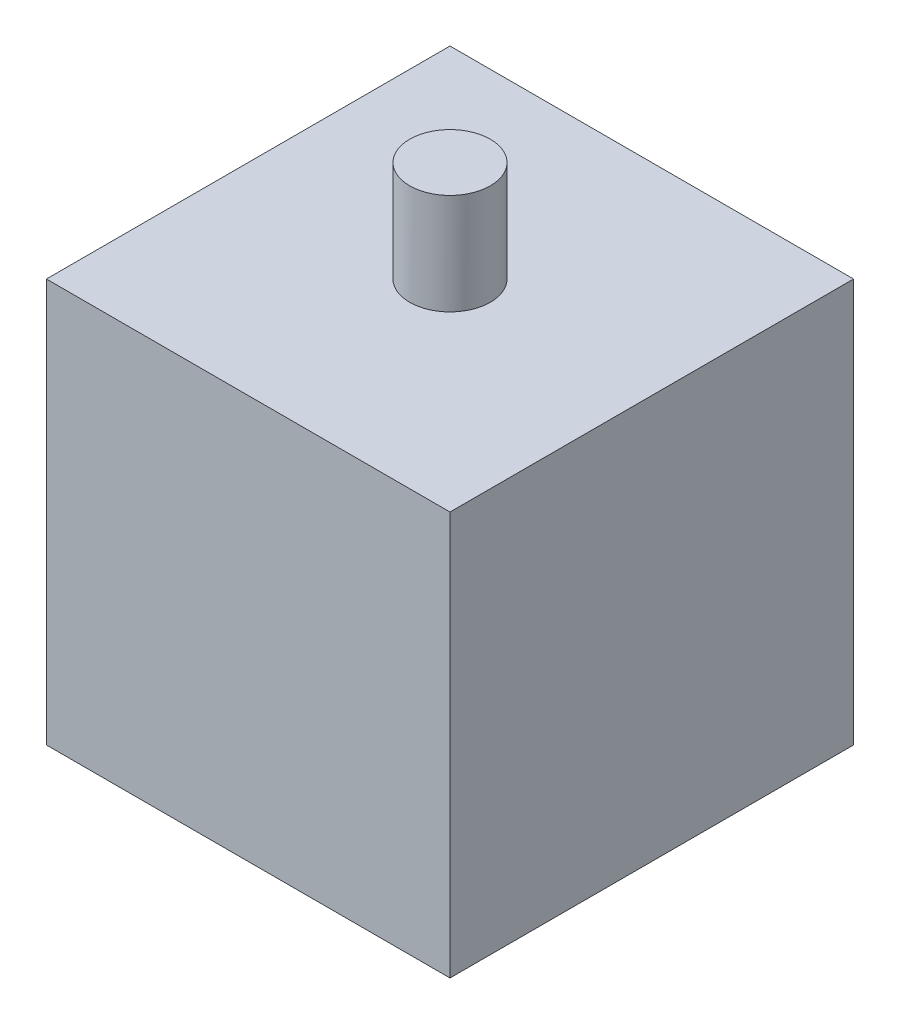
ISO-10303-21;
HEADER;
FILE_DESCRIPTION(('STEP AP214'),'2;1');
FILE_NAME('part.step','',(''),(''),'','','');
FILE_SCHEMA(('AUTOMOTIVE_DESIGN { 1 0 10303 214 1 1 1 1 }'));
ENDSEC;
DATA;
#1=APPLICATION_CONTEXT('core data for automotive mechanical design processes');
#2=APPLICATION_PROTOCOL_DEFINITION('international standard','automotive_design',2000,#1);
#3=PRODUCT_CONTEXT('',#1,'mechanical');
#4=PRODUCT('Part','Part','',(#3));
#5=PRODUCT_RELATED_PRODUCT_CATEGORY('part','',(#4));
#6=PRODUCT_DEFINITION_FORMATION('','',#4);
#7=PRODUCT_DEFINITION_CONTEXT('part definition',#1,'design');
#8=PRODUCT_DEFINITION('design','',#6,#7);
#9=PRODUCT_DEFINITION_SHAPE('','',#8);
#10=(LENGTH_UNIT() NAMED_UNIT(*) SI_UNIT(.MILLI.,.METRE.));
#11=(NAMED_UNIT(*) PLANE_ANGLE_UNIT() SI_UNIT($,.RADIAN.));
#12=(NAMED_UNIT(*) SI_UNIT($,.STERADIAN.) SOLID_ANGLE_UNIT());
#13=UNCERTAINTY_MEASURE_WITH_UNIT(LENGTH_MEASURE(1.E-05),#10,'distance_accuracy_value','');
#14=(GEOMETRIC_REPRESENTATION_CONTEXT(3) GLOBAL_UNCERTAINTY_ASSIGNED_CONTEXT((#13)) GLOBAL_UNIT_ASSIGNED_CONTEXT((#10,
#11,#12)) REPRESENTATION_CONTEXT('',''));
#15=CARTESIAN_POINT('',(0.,0.,0.));
#16=DIRECTION('',(0.,0.,1.));
#17=DIRECTION('',(1.,0.,0.));
#18=AXIS2_PLACEMENT_3D('',#15,#16,#17);
#19=CARTESIAN_POINT('',(0.,100.,0.));
#20=DIRECTION('',(1.,0.,0.));
#21=DIRECTION('',(0.,0.,-1.));
#22=AXIS2_PLACEMENT_3D('',#19,#20,#21);
#23=PLANE('',#22);
#24=DIRECTION('',(0.,0.,1.));
#25=VECTOR('',#24,1.);
#26=CARTESIAN_POINT('',(0.,0.,0.));
#27=LINE('',#26,#25);
#28=CARTESIAN_POINT('',(0.,0.,-100.));
#29=VERTEX_POINT('',#28);
#30=CARTESIAN_POINT('',(0.,0.,0.));
#31=VERTEX_POINT('',#30);
#32=EDGE_CURVE('E110',#29,#31,#27,.T.);
#33=ORIENTED_EDGE('',*,*,#32,.T.);
#34=DIRECTION('',(0.,-1.,0.));
#35=VECTOR('',#34,1.);
#36=CARTESIAN_POINT('',(0.,100.,0.));
#37=LINE('',#36,#35);
#38=CARTESIAN_POINT('',(0.,100.,0.));
#39=VERTEX_POINT('',#38);
#40=EDGE_CURVE('E52',#39,#31,#37,.T.);
#41=ORIENTED_EDGE('',*,*,#40,.F.);
#42=DIRECTION('',(0.,0.,1.));
#43=VECTOR('',#42,1.);
#44=CARTESIAN_POINT('',(0.,100.,0.));
#45=LINE('',#44,#43);
#46=CARTESIAN_POINT('',(0.,100.,-100.));
#47=VERTEX_POINT('',#46);
#48=EDGE_CURVE('E96',#47,#39,#45,.T.);
#49=ORIENTED_EDGE('',*,*,#48,.F.);
#50=DIRECTION('',(0.,-1.,0.));
#51=VECTOR('',#50,1.);
#52=CARTESIAN_POINT('',(0.,100.,-100.));
#53=LINE('',#52,#51);
#54=EDGE_CURVE('E106',#47,#29,#53,.T.);
#55=ORIENTED_EDGE('',*,*,#54,.T.);
#56=EDGE_LOOP('',(#33,#41,#49,#55));
#57=FACE_BOUND('',#56,.T.);
#58=ADVANCED_FACE('F44',(#57),#23,.F.);
#59=CARTESIAN_POINT('',(0.,100.,0.));
#60=DIRECTION('',(0.,0.,-1.));
#61=DIRECTION('',(-1.,0.,0.));
#62=AXIS2_PLACEMENT_3D('',#59,#60,#61);
#63=PLANE('',#62);
#64=DIRECTION('',(1.,0.,0.));
#65=VECTOR('',#64,1.);
#66=CARTESIAN_POINT('',(0.,0.,0.));
#67=LINE('',#66,#65);
#68=CARTESIAN_POINT('',(100.,0.,0.));
#69=VERTEX_POINT('',#68);
#70=EDGE_CURVE('E101',#31,#69,#67,.T.);
#71=ORIENTED_EDGE('',*,*,#70,.T.);
#72=DIRECTION('',(0.,-1.,0.));
#73=VECTOR('',#72,1.);
#74=CARTESIAN_POINT('',(100.,100.,0.));
#75=LINE('',#74,#73);
#76=CARTESIAN_POINT('',(100.,100.,0.));
#77=VERTEX_POINT('',#76);
#78=EDGE_CURVE('E99',#77,#69,#75,.T.);
#79=ORIENTED_EDGE('',*,*,#78,.F.);
#80=DIRECTION('',(1.,0.,0.));
#81=VECTOR('',#80,1.);
#82=CARTESIAN_POINT('',(0.,100.,0.));
#83=LINE('',#82,#81);
#84=EDGE_CURVE('E91',#39,#77,#83,.T.);
#85=ORIENTED_EDGE('',*,*,#84,.F.);
#86=ORIENTED_EDGE('',*,*,#40,.T.);
#87=EDGE_LOOP('',(#71,#79,#85,#86));
#88=FACE_BOUND('',#87,.T.);
#89=ADVANCED_FACE('F100',(#88),#63,.F.);
#90=CARTESIAN_POINT('',(100.,100.,0.));
#91=DIRECTION('',(-1.,0.,0.));
#92=DIRECTION('',(0.,0.,1.));
#93=AXIS2_PLACEMENT_3D('',#90,#91,#92);
#94=PLANE('',#93);
#95=DIRECTION('',(0.,0.,-1.));
#96=VECTOR('',#95,1.);
#97=CARTESIAN_POINT('',(100.,0.,0.));
#98=LINE('',#97,#96);
#99=CARTESIAN_POINT('',(100.,0.,-100.));
#100=VERTEX_POINT('',#99);
#101=EDGE_CURVE('E77',#69,#100,#98,.T.);
#102=ORIENTED_EDGE('',*,*,#101,.T.);
#103=DIRECTION('',(0.,-1.,0.));
#104=VECTOR('',#103,1.);
#105=CARTESIAN_POINT('',(100.,100.,-100.));
#106=LINE('',#105,#104);
#107=CARTESIAN_POINT('',(100.,100.,-100.));
#108=VERTEX_POINT('',#107);
#109=EDGE_CURVE('E102',#108,#100,#106,.T.);
#110=ORIENTED_EDGE('',*,*,#109,.F.);
#111=DIRECTION('',(0.,0.,-1.));
#112=VECTOR('',#111,1.);
#113=CARTESIAN_POINT('',(100.,100.,0.));
#114=LINE('',#113,#112);
#115=EDGE_CURVE('E94',#77,#108,#114,.T.);
#116=ORIENTED_EDGE('',*,*,#115,.F.);
#117=ORIENTED_EDGE('',*,*,#78,.T.);
#118=EDGE_LOOP('',(#102,#110,#116,#117));
#119=FACE_BOUND('',#118,.T.);
#120=ADVANCED_FACE('F104',(#119),#94,.F.);
#121=CARTESIAN_POINT('',(0.,100.,-100.));
#122=DIRECTION('',(0.,0.,1.));
#123=DIRECTION('',(1.,0.,0.));
#124=AXIS2_PLACEMENT_3D('',#121,#122,#123);
#125=PLANE('',#124);
#126=DIRECTION('',(-1.,0.,0.));
#127=VECTOR('',#126,1.);
#128=CARTESIAN_POINT('',(0.,0.,-100.));
#129=LINE('',#128,#127);
#130=EDGE_CURVE('E83',#100,#29,#129,.T.);
#131=ORIENTED_EDGE('',*,*,#130,.T.);
#132=ORIENTED_EDGE('',*,*,#54,.F.);
#133=DIRECTION('',(-1.,0.,0.));
#134=VECTOR('',#133,1.);
#135=CARTESIAN_POINT('',(0.,100.,-100.));
#136=LINE('',#135,#134);
#137=EDGE_CURVE('E60',#108,#47,#136,.T.);
#138=ORIENTED_EDGE('',*,*,#137,.F.);
#139=ORIENTED_EDGE('',*,*,#109,.T.);
#140=EDGE_LOOP('',(#131,#132,#138,#139));
#141=FACE_BOUND('',#140,.T.);
#142=ADVANCED_FACE('F132',(#141),#125,.F.);
#143=CARTESIAN_POINT('',(0.,100.,0.));
#144=DIRECTION('',(0.,-1.,0.));
#145=DIRECTION('',(0.,0.,-1.));
#146=AXIS2_PLACEMENT_3D('',#143,#144,#145);
#147=PLANE('',#146);
#148=CARTESIAN_POINT('',(50.,100.,-50.));
#149=DIRECTION('',(0.,-1.,0.));
#150=DIRECTION('',(0.,0.,-1.));
#151=AXIS2_PLACEMENT_3D('',#148,#149,#150);
#152=CIRCLE('',#151,10.);
#153=CARTESIAN_POINT('',(50.,100.,-60.));
#154=VERTEX_POINT('',#153);
#155=EDGE_CURVE('E11',#154,#154,#152,.F.);
#156=ORIENTED_EDGE('',*,*,#155,.F.);
#157=EDGE_LOOP('',(#156));
#158=FACE_BOUND('',#157,.T.);
#159=ORIENTED_EDGE('',*,*,#48,.T.);
#160=ORIENTED_EDGE('',*,*,#84,.T.);
#161=ORIENTED_EDGE('',*,*,#115,.T.);
#162=ORIENTED_EDGE('',*,*,#137,.T.);
#163=EDGE_LOOP('',(#159,#160,#161,#162));
#164=FACE_BOUND('',#163,.T.);
#165=ADVANCED_FACE('F92',(#158,#164),#147,.F.);
#166=CARTESIAN_POINT('',(0.,0.,0.));
#167=DIRECTION('',(0.,-1.,0.));
#168=DIRECTION('',(0.,0.,-1.));
#169=AXIS2_PLACEMENT_3D('',#166,#167,#168);
#170=PLANE('',#169);
#171=ORIENTED_EDGE('',*,*,#32,.F.);
#172=ORIENTED_EDGE('',*,*,#130,.F.);
#173=ORIENTED_EDGE('',*,*,#101,.F.);
#174=ORIENTED_EDGE('',*,*,#70,.F.);
#175=EDGE_LOOP('',(#171,#172,#173,#174));
#176=FACE_BOUND('',#175,.T.);
#177=ADVANCED_FACE('F121',(#176),#170,.T.);
#178=CARTESIAN_POINT('',(50.,125.,-50.));
#179=DIRECTION('',(0.,-1.,0.));
#180=DIRECTION('',(0.,0.,-1.));
#181=AXIS2_PLACEMENT_3D('',#178,#179,#180);
#182=CYLINDRICAL_SURFACE('',#181,10.);
#183=CARTESIAN_POINT('',(50.,125.,-50.));
#184=DIRECTION('',(0.,1.,0.));
#185=DIRECTION('',(0.,0.,1.));
#186=AXIS2_PLACEMENT_3D('',#183,#184,#185);
#187=CIRCLE('',#186,10.);
#188=CARTESIAN_POINT('',(50.,125.,-40.));
#189=VERTEX_POINT('',#188);
#190=EDGE_CURVE('E113',#189,#189,#187,.T.);
#191=ORIENTED_EDGE('',*,*,#190,.F.);
#192=EDGE_LOOP('',(#191));
#193=FACE_BOUND('',#192,.T.);
#194=ORIENTED_EDGE('',*,*,#155,.T.);
#195=EDGE_LOOP('',(#194));
#196=FACE_BOUND('',#195,.T.);
#197=ADVANCED_FACE('F123',(#193,#196),#182,.T.);
#198=CARTESIAN_POINT('',(50.,125.,-50.));
#199=DIRECTION('',(0.,1.,0.));
#200=DIRECTION('',(0.,0.,1.));
#201=AXIS2_PLACEMENT_3D('',#198,#199,#200);
#202=PLANE('',#201);
#203=ORIENTED_EDGE('',*,*,#190,.T.);
#204=EDGE_LOOP('',(#203));
#205=FACE_BOUND('',#204,.T.);
#206=ADVANCED_FACE('F129',(#205),#202,.T.);
#207=CLOSED_SHELL('',(#58,#89,#120,#142,#165,#177,#197,#206));
#208=MANIFOLD_SOLID_BREP('B2',#207);
#209=ADVANCED_BREP_SHAPE_REPRESENTATION('',(#18,#208),#14);
#210=SHAPE_DEFINITION_REPRESENTATION(#9,#209);
ENDSEC;
END-ISO-10303-21;
